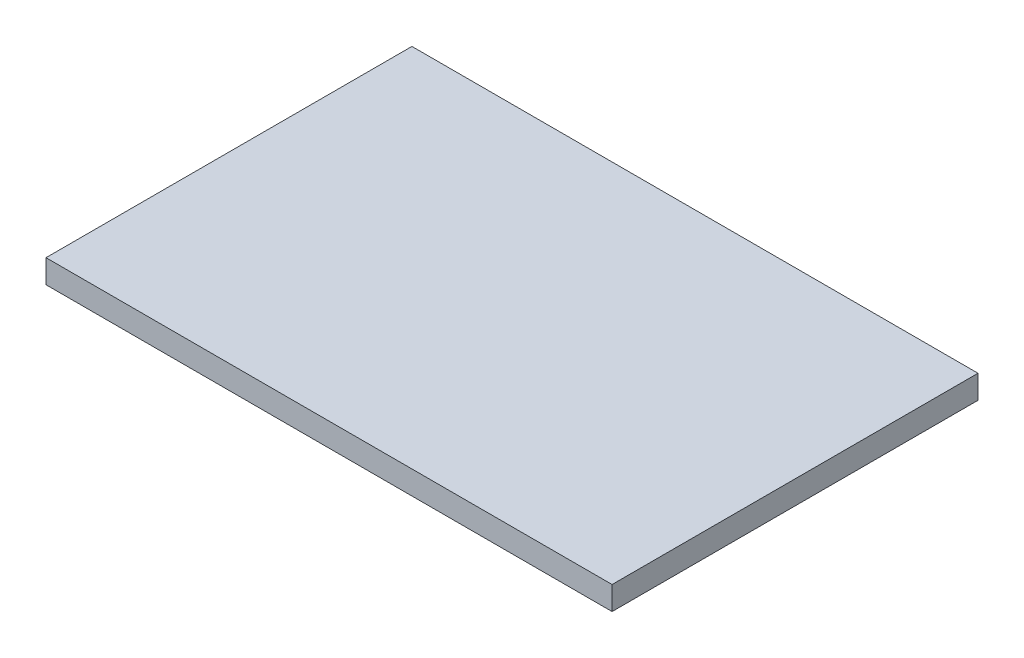
ISO-10303-21;
HEADER;
FILE_DESCRIPTION(('STEP AP214'),'2;1');
FILE_NAME('part.step','',(''),(''),'','','');
FILE_SCHEMA(('AUTOMOTIVE_DESIGN { 1 0 10303 214 1 1 1 1 }'));
ENDSEC;
DATA;
#1=APPLICATION_CONTEXT('core data for automotive mechanical design processes');
#2=APPLICATION_PROTOCOL_DEFINITION('international standard','automotive_design',2000,#1);
#3=PRODUCT_CONTEXT('',#1,'mechanical');
#4=PRODUCT('Part','Part','',(#3));
#5=PRODUCT_RELATED_PRODUCT_CATEGORY('part','',(#4));
#6=PRODUCT_DEFINITION_FORMATION('','',#4);
#7=PRODUCT_DEFINITION_CONTEXT('part definition',#1,'design');
#8=PRODUCT_DEFINITION('design','',#6,#7);
#9=PRODUCT_DEFINITION_SHAPE('','',#8);
#10=(LENGTH_UNIT() NAMED_UNIT(*) SI_UNIT(.MILLI.,.METRE.));
#11=(NAMED_UNIT(*) PLANE_ANGLE_UNIT() SI_UNIT($,.RADIAN.));
#12=(NAMED_UNIT(*) SI_UNIT($,.STERADIAN.) SOLID_ANGLE_UNIT());
#13=UNCERTAINTY_MEASURE_WITH_UNIT(LENGTH_MEASURE(1.E-05),#10,'distance_accuracy_value','');
#14=(GEOMETRIC_REPRESENTATION_CONTEXT(3) GLOBAL_UNCERTAINTY_ASSIGNED_CONTEXT((#13)) GLOBAL_UNIT_ASSIGNED_CONTEXT((#10,
#11,#12)) REPRESENTATION_CONTEXT('',''));
#15=CARTESIAN_POINT('',(0.,0.,0.));
#16=DIRECTION('',(0.,0.,1.));
#17=DIRECTION('',(1.,0.,0.));
#18=AXIS2_PLACEMENT_3D('',#15,#16,#17);
#19=CARTESIAN_POINT('',(0.,1.5,0.));
#20=DIRECTION('',(1.,0.,0.));
#21=DIRECTION('',(0.,0.,-1.));
#22=AXIS2_PLACEMENT_3D('',#19,#20,#21);
#23=PLANE('',#22);
#24=DIRECTION('',(0.,0.,1.));
#25=VECTOR('',#24,1.);
#26=CARTESIAN_POINT('',(0.,0.,0.));
#27=LINE('',#26,#25);
#28=CARTESIAN_POINT('',(0.,0.,-23.4));
#29=VERTEX_POINT('',#28);
#30=CARTESIAN_POINT('',(0.,0.,0.));
#31=VERTEX_POINT('',#30);
#32=EDGE_CURVE('E97',#29,#31,#27,.T.);
#33=ORIENTED_EDGE('',*,*,#32,.T.);
#34=DIRECTION('',(0.,-1.,0.));
#35=VECTOR('',#34,1.);
#36=CARTESIAN_POINT('',(0.,1.5,0.));
#37=LINE('',#36,#35);
#38=CARTESIAN_POINT('',(0.,1.5,0.));
#39=VERTEX_POINT('',#38);
#40=EDGE_CURVE('E11',#39,#31,#37,.T.);
#41=ORIENTED_EDGE('',*,*,#40,.F.);
#42=DIRECTION('',(0.,0.,1.));
#43=VECTOR('',#42,1.);
#44=CARTESIAN_POINT('',(0.,1.5,0.));
#45=LINE('',#44,#43);
#46=CARTESIAN_POINT('',(0.,1.5,-23.4));
#47=VERTEX_POINT('',#46);
#48=EDGE_CURVE('E85',#47,#39,#45,.T.);
#49=ORIENTED_EDGE('',*,*,#48,.F.);
#50=DIRECTION('',(0.,-1.,0.));
#51=VECTOR('',#50,1.);
#52=CARTESIAN_POINT('',(0.,1.5,-23.4));
#53=LINE('',#52,#51);
#54=EDGE_CURVE('E93',#47,#29,#53,.T.);
#55=ORIENTED_EDGE('',*,*,#54,.T.);
#56=EDGE_LOOP('',(#33,#41,#49,#55));
#57=FACE_BOUND('',#56,.T.);
#58=ADVANCED_FACE('F34',(#57),#23,.F.);
#59=CARTESIAN_POINT('',(0.,1.5,0.));
#60=DIRECTION('',(0.,0.,-1.));
#61=DIRECTION('',(-1.,0.,0.));
#62=AXIS2_PLACEMENT_3D('',#59,#60,#61);
#63=PLANE('',#62);
#64=DIRECTION('',(1.,0.,0.));
#65=VECTOR('',#64,1.);
#66=CARTESIAN_POINT('',(0.,0.,0.));
#67=LINE('',#66,#65);
#68=CARTESIAN_POINT('',(36.2,0.,0.));
#69=VERTEX_POINT('',#68);
#70=EDGE_CURVE('E89',#31,#69,#67,.T.);
#71=ORIENTED_EDGE('',*,*,#70,.T.);
#72=DIRECTION('',(0.,-1.,0.));
#73=VECTOR('',#72,1.);
#74=CARTESIAN_POINT('',(36.2,1.5,0.));
#75=LINE('',#74,#73);
#76=CARTESIAN_POINT('',(36.2,1.5,0.));
#77=VERTEX_POINT('',#76);
#78=EDGE_CURVE('E42',#77,#69,#75,.T.);
#79=ORIENTED_EDGE('',*,*,#78,.F.);
#80=DIRECTION('',(1.,0.,0.));
#81=VECTOR('',#80,1.);
#82=CARTESIAN_POINT('',(0.,1.5,0.));
#83=LINE('',#82,#81);
#84=EDGE_CURVE('E80',#39,#77,#83,.T.);
#85=ORIENTED_EDGE('',*,*,#84,.F.);
#86=ORIENTED_EDGE('',*,*,#40,.T.);
#87=EDGE_LOOP('',(#71,#79,#85,#86));
#88=FACE_BOUND('',#87,.T.);
#89=ADVANCED_FACE('F88',(#88),#63,.F.);
#90=CARTESIAN_POINT('',(36.2,1.5,0.));
#91=DIRECTION('',(-1.,0.,0.));
#92=DIRECTION('',(0.,0.,1.));
#93=AXIS2_PLACEMENT_3D('',#90,#91,#92);
#94=PLANE('',#93);
#95=DIRECTION('',(0.,0.,-1.));
#96=VECTOR('',#95,1.);
#97=CARTESIAN_POINT('',(36.2,0.,0.));
#98=LINE('',#97,#96);
#99=CARTESIAN_POINT('',(36.2,0.,-23.4));
#100=VERTEX_POINT('',#99);
#101=EDGE_CURVE('E67',#69,#100,#98,.T.);
#102=ORIENTED_EDGE('',*,*,#101,.T.);
#103=DIRECTION('',(0.,-1.,0.));
#104=VECTOR('',#103,1.);
#105=CARTESIAN_POINT('',(36.2,1.5,-23.4));
#106=LINE('',#105,#104);
#107=CARTESIAN_POINT('',(36.2,1.5,-23.4));
#108=VERTEX_POINT('',#107);
#109=EDGE_CURVE('E90',#108,#100,#106,.T.);
#110=ORIENTED_EDGE('',*,*,#109,.F.);
#111=DIRECTION('',(0.,0.,-1.));
#112=VECTOR('',#111,1.);
#113=CARTESIAN_POINT('',(36.2,1.5,0.));
#114=LINE('',#113,#112);
#115=EDGE_CURVE('E83',#77,#108,#114,.T.);
#116=ORIENTED_EDGE('',*,*,#115,.F.);
#117=ORIENTED_EDGE('',*,*,#78,.T.);
#118=EDGE_LOOP('',(#102,#110,#116,#117));
#119=FACE_BOUND('',#118,.T.);
#120=ADVANCED_FACE('F91',(#119),#94,.F.);
#121=CARTESIAN_POINT('',(0.,1.5,-23.4));
#122=DIRECTION('',(0.,0.,1.));
#123=DIRECTION('',(1.,0.,0.));
#124=AXIS2_PLACEMENT_3D('',#121,#122,#123);
#125=PLANE('',#124);
#126=DIRECTION('',(-1.,0.,0.));
#127=VECTOR('',#126,1.);
#128=CARTESIAN_POINT('',(0.,0.,-23.4));
#129=LINE('',#128,#127);
#130=EDGE_CURVE('E73',#100,#29,#129,.T.);
#131=ORIENTED_EDGE('',*,*,#130,.T.);
#132=ORIENTED_EDGE('',*,*,#54,.F.);
#133=DIRECTION('',(-1.,0.,0.));
#134=VECTOR('',#133,1.);
#135=CARTESIAN_POINT('',(0.,1.5,-23.4));
#136=LINE('',#135,#134);
#137=EDGE_CURVE('E50',#108,#47,#136,.T.);
#138=ORIENTED_EDGE('',*,*,#137,.F.);
#139=ORIENTED_EDGE('',*,*,#109,.T.);
#140=EDGE_LOOP('',(#131,#132,#138,#139));
#141=FACE_BOUND('',#140,.T.);
#142=ADVANCED_FACE('F104',(#141),#125,.F.);
#143=CARTESIAN_POINT('',(0.,1.5,0.));
#144=DIRECTION('',(0.,-1.,0.));
#145=DIRECTION('',(0.,0.,-1.));
#146=AXIS2_PLACEMENT_3D('',#143,#144,#145);
#147=PLANE('',#146);
#148=ORIENTED_EDGE('',*,*,#48,.T.);
#149=ORIENTED_EDGE('',*,*,#84,.T.);
#150=ORIENTED_EDGE('',*,*,#115,.T.);
#151=ORIENTED_EDGE('',*,*,#137,.T.);
#152=EDGE_LOOP('',(#148,#149,#150,#151));
#153=FACE_BOUND('',#152,.T.);
#154=ADVANCED_FACE('F81',(#153),#147,.F.);
#155=CARTESIAN_POINT('',(0.,0.,0.));
#156=DIRECTION('',(0.,-1.,0.));
#157=DIRECTION('',(0.,0.,-1.));
#158=AXIS2_PLACEMENT_3D('',#155,#156,#157);
#159=PLANE('',#158);
#160=ORIENTED_EDGE('',*,*,#32,.F.);
#161=ORIENTED_EDGE('',*,*,#130,.F.);
#162=ORIENTED_EDGE('',*,*,#101,.F.);
#163=ORIENTED_EDGE('',*,*,#70,.F.);
#164=EDGE_LOOP('',(#160,#161,#162,#163));
#165=FACE_BOUND('',#164,.T.);
#166=ADVANCED_FACE('F107',(#165),#159,.T.);
#167=CLOSED_SHELL('',(#58,#89,#120,#142,#154,#166));
#168=MANIFOLD_SOLID_BREP('B2',#167);
#169=ADVANCED_BREP_SHAPE_REPRESENTATION('',(#18,#168),#14);
#170=SHAPE_DEFINITION_REPRESENTATION(#9,#169);
ENDSEC;
END-ISO-10303-21;
